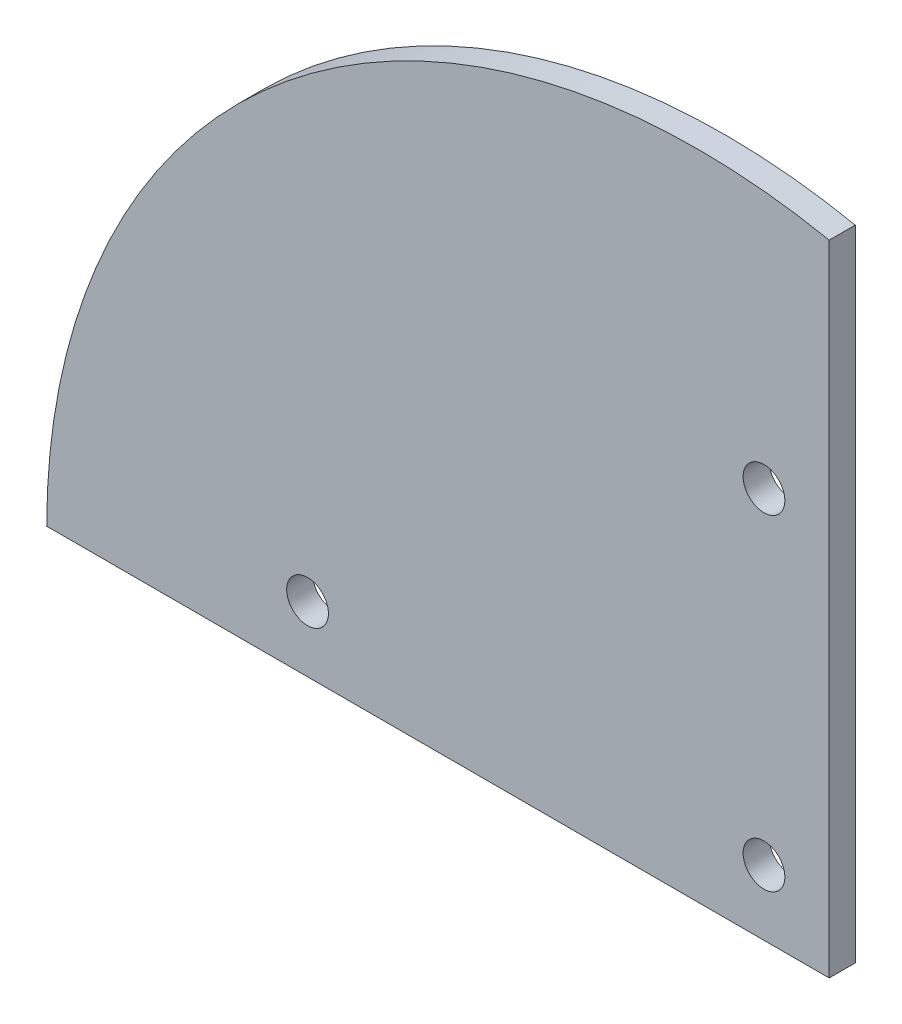
ISO-10303-21;
HEADER;
FILE_DESCRIPTION(('STEP AP214'),'2;1');
FILE_NAME('part.step','',(''),(''),'','','');
FILE_SCHEMA(('AUTOMOTIVE_DESIGN { 1 0 10303 214 1 1 1 1 }'));
ENDSEC;
DATA;
#1=APPLICATION_CONTEXT('core data for automotive mechanical design processes');
#2=APPLICATION_PROTOCOL_DEFINITION('international standard','automotive_design',2000,#1);
#3=PRODUCT_CONTEXT('',#1,'mechanical');
#4=PRODUCT('Part','Part','',(#3));
#5=PRODUCT_RELATED_PRODUCT_CATEGORY('part','',(#4));
#6=PRODUCT_DEFINITION_FORMATION('','',#4);
#7=PRODUCT_DEFINITION_CONTEXT('part definition',#1,'design');
#8=PRODUCT_DEFINITION('design','',#6,#7);
#9=PRODUCT_DEFINITION_SHAPE('','',#8);
#10=(LENGTH_UNIT() NAMED_UNIT(*) SI_UNIT(.MILLI.,.METRE.));
#11=(NAMED_UNIT(*) PLANE_ANGLE_UNIT() SI_UNIT($,.RADIAN.));
#12=(NAMED_UNIT(*) SI_UNIT($,.STERADIAN.) SOLID_ANGLE_UNIT());
#13=UNCERTAINTY_MEASURE_WITH_UNIT(LENGTH_MEASURE(1.E-05),#10,'distance_accuracy_value','');
#14=(GEOMETRIC_REPRESENTATION_CONTEXT(3) GLOBAL_UNCERTAINTY_ASSIGNED_CONTEXT((#13)) GLOBAL_UNIT_ASSIGNED_CONTEXT((#10,
#11,#12)) REPRESENTATION_CONTEXT('',''));
#15=CARTESIAN_POINT('',(0.,0.,0.));
#16=DIRECTION('',(0.,0.,1.));
#17=DIRECTION('',(1.,0.,0.));
#18=AXIS2_PLACEMENT_3D('',#15,#16,#17);
#19=CARTESIAN_POINT('',(60.,0.,2.));
#20=DIRECTION('',(-1.,0.,0.));
#21=DIRECTION('',(0.,0.,1.));
#22=AXIS2_PLACEMENT_3D('',#19,#20,#21);
#23=PLANE('',#22);
#24=DIRECTION('',(0.,1.,0.));
#25=VECTOR('',#24,1.);
#26=CARTESIAN_POINT('',(60.,0.,0.));
#27=LINE('',#26,#25);
#28=CARTESIAN_POINT('',(60.,0.,0.));
#29=VERTEX_POINT('',#28);
#30=CARTESIAN_POINT('',(60.,49.,0.));
#31=VERTEX_POINT('',#30);
#32=EDGE_CURVE('E83',#29,#31,#27,.T.);
#33=ORIENTED_EDGE('',*,*,#32,.T.);
#34=DIRECTION('',(0.,0.,-1.));
#35=VECTOR('',#34,1.);
#36=CARTESIAN_POINT('',(60.,49.,2.));
#37=LINE('',#36,#35);
#38=CARTESIAN_POINT('',(60.,49.,2.));
#39=VERTEX_POINT('',#38);
#40=EDGE_CURVE('E11',#39,#31,#37,.T.);
#41=ORIENTED_EDGE('',*,*,#40,.F.);
#42=DIRECTION('',(0.,1.,0.));
#43=VECTOR('',#42,1.);
#44=CARTESIAN_POINT('',(60.,0.,2.));
#45=LINE('',#44,#43);
#46=CARTESIAN_POINT('',(60.,0.,2.));
#47=VERTEX_POINT('',#46);
#48=EDGE_CURVE('E75',#47,#39,#45,.T.);
#49=ORIENTED_EDGE('',*,*,#48,.F.);
#50=DIRECTION('',(0.,0.,-1.));
#51=VECTOR('',#50,1.);
#52=CARTESIAN_POINT('',(60.,0.,2.));
#53=LINE('',#52,#51);
#54=EDGE_CURVE('E84',#47,#29,#53,.T.);
#55=ORIENTED_EDGE('',*,*,#54,.T.);
#56=EDGE_LOOP('',(#33,#41,#49,#55));
#57=FACE_BOUND('',#56,.T.);
#58=ADVANCED_FACE('F34',(#57),#23,.F.);
#59=CARTESIAN_POINT('',(50.0049998334028,0.00408183664968656,2.));
#60=DIRECTION('',(0.,0.,-1.));
#61=DIRECTION('',(-1.,0.,0.));
#62=AXIS2_PLACEMENT_3D('',#59,#60,#61);
#63=CYLINDRICAL_SURFACE('',#62,50.005);
#64=CARTESIAN_POINT('',(50.0049998334028,0.00408183664968656,0.));
#65=DIRECTION('',(0.,0.,1.));
#66=DIRECTION('',(1.,0.,0.));
#67=AXIS2_PLACEMENT_3D('',#64,#65,#66);
#68=CIRCLE('',#67,50.005);
#69=CARTESIAN_POINT('',(0.,0.,0.));
#70=VERTEX_POINT('',#69);
#71=EDGE_CURVE('E63',#31,#70,#68,.T.);
#72=ORIENTED_EDGE('',*,*,#71,.T.);
#73=DIRECTION('',(0.,0.,-1.));
#74=VECTOR('',#73,1.);
#75=CARTESIAN_POINT('',(0.,0.,2.));
#76=LINE('',#75,#74);
#77=CARTESIAN_POINT('',(0.,0.,2.));
#78=VERTEX_POINT('',#77);
#79=EDGE_CURVE('E43',#78,#70,#76,.T.);
#80=ORIENTED_EDGE('',*,*,#79,.F.);
#81=CARTESIAN_POINT('',(50.0049998334028,0.00408183664968656,2.));
#82=DIRECTION('',(0.,0.,1.));
#83=DIRECTION('',(1.,0.,0.));
#84=AXIS2_PLACEMENT_3D('',#81,#82,#83);
#85=CIRCLE('',#84,50.005);
#86=EDGE_CURVE('E71',#39,#78,#85,.T.);
#87=ORIENTED_EDGE('',*,*,#86,.F.);
#88=ORIENTED_EDGE('',*,*,#40,.T.);
#89=EDGE_LOOP('',(#72,#80,#87,#88));
#90=FACE_BOUND('',#89,.T.);
#91=ADVANCED_FACE('F72',(#90),#63,.T.);
#92=CARTESIAN_POINT('',(55.,5.,2.));
#93=DIRECTION('',(0.,0.,-1.));
#94=DIRECTION('',(-1.,0.,0.));
#95=AXIS2_PLACEMENT_3D('',#92,#93,#94);
#96=CYLINDRICAL_SURFACE('',#95,1.6);
#97=CARTESIAN_POINT('',(55.,5.,2.));
#98=DIRECTION('',(0.,0.,1.));
#99=DIRECTION('',(1.,0.,0.));
#100=AXIS2_PLACEMENT_3D('',#97,#98,#99);
#101=CIRCLE('',#100,1.6);
#102=CARTESIAN_POINT('',(56.6,5.,2.));
#103=VERTEX_POINT('',#102);
#104=EDGE_CURVE('E80',#103,#103,#101,.T.);
#105=ORIENTED_EDGE('',*,*,#104,.T.);
#106=EDGE_LOOP('',(#105));
#107=FACE_BOUND('',#106,.T.);
#108=CARTESIAN_POINT('',(55.,5.,0.));
#109=DIRECTION('',(0.,0.,1.));
#110=DIRECTION('',(1.,0.,0.));
#111=AXIS2_PLACEMENT_3D('',#108,#109,#110);
#112=CIRCLE('',#111,1.6);
#113=CARTESIAN_POINT('',(56.6,5.,0.));
#114=VERTEX_POINT('',#113);
#115=EDGE_CURVE('E86',#114,#114,#112,.T.);
#116=ORIENTED_EDGE('',*,*,#115,.F.);
#117=EDGE_LOOP('',(#116));
#118=FACE_BOUND('',#117,.T.);
#119=ADVANCED_FACE('F114',(#107,#118),#96,.F.);
#120=CARTESIAN_POINT('',(55.,30.,2.));
#121=DIRECTION('',(0.,0.,-1.));
#122=DIRECTION('',(-1.,0.,0.));
#123=AXIS2_PLACEMENT_3D('',#120,#121,#122);
#124=CYLINDRICAL_SURFACE('',#123,1.6);
#125=CARTESIAN_POINT('',(55.,30.,2.));
#126=DIRECTION('',(0.,0.,1.));
#127=DIRECTION('',(1.,0.,0.));
#128=AXIS2_PLACEMENT_3D('',#125,#126,#127);
#129=CIRCLE('',#128,1.6);
#130=CARTESIAN_POINT('',(56.6,30.,2.));
#131=VERTEX_POINT('',#130);
#132=EDGE_CURVE('E129',#131,#131,#129,.T.);
#133=ORIENTED_EDGE('',*,*,#132,.T.);
#134=EDGE_LOOP('',(#133));
#135=FACE_BOUND('',#134,.T.);
#136=CARTESIAN_POINT('',(55.,30.,0.));
#137=DIRECTION('',(0.,0.,1.));
#138=DIRECTION('',(1.,0.,0.));
#139=AXIS2_PLACEMENT_3D('',#136,#137,#138);
#140=CIRCLE('',#139,1.6);
#141=CARTESIAN_POINT('',(56.6,30.,0.));
#142=VERTEX_POINT('',#141);
#143=EDGE_CURVE('E90',#142,#142,#140,.T.);
#144=ORIENTED_EDGE('',*,*,#143,.F.);
#145=EDGE_LOOP('',(#144));
#146=FACE_BOUND('',#145,.T.);
#147=ADVANCED_FACE('F118',(#135,#146),#124,.F.);
#148=CARTESIAN_POINT('',(20.,5.,2.));
#149=DIRECTION('',(0.,0.,-1.));
#150=DIRECTION('',(-1.,0.,0.));
#151=AXIS2_PLACEMENT_3D('',#148,#149,#150);
#152=CYLINDRICAL_SURFACE('',#151,1.6);
#153=CARTESIAN_POINT('',(20.,5.,2.));
#154=DIRECTION('',(0.,0.,1.));
#155=DIRECTION('',(1.,0.,0.));
#156=AXIS2_PLACEMENT_3D('',#153,#154,#155);
#157=CIRCLE('',#156,1.6);
#158=CARTESIAN_POINT('',(21.6,5.,2.));
#159=VERTEX_POINT('',#158);
#160=EDGE_CURVE('E95',#159,#159,#157,.T.);
#161=ORIENTED_EDGE('',*,*,#160,.T.);
#162=EDGE_LOOP('',(#161));
#163=FACE_BOUND('',#162,.T.);
#164=CARTESIAN_POINT('',(20.,5.,0.));
#165=DIRECTION('',(0.,0.,1.));
#166=DIRECTION('',(1.,0.,0.));
#167=AXIS2_PLACEMENT_3D('',#164,#165,#166);
#168=CIRCLE('',#167,1.6);
#169=CARTESIAN_POINT('',(21.6,5.,0.));
#170=VERTEX_POINT('',#169);
#171=EDGE_CURVE('E132',#170,#170,#168,.T.);
#172=ORIENTED_EDGE('',*,*,#171,.F.);
#173=EDGE_LOOP('',(#172));
#174=FACE_BOUND('',#173,.T.);
#175=ADVANCED_FACE('F36',(#163,#174),#152,.F.);
#176=CARTESIAN_POINT('',(0.,0.,2.));
#177=DIRECTION('',(0.,1.,0.));
#178=DIRECTION('',(0.,0.,1.));
#179=AXIS2_PLACEMENT_3D('',#176,#177,#178);
#180=PLANE('',#179);
#181=DIRECTION('',(1.,0.,0.));
#182=VECTOR('',#181,1.);
#183=CARTESIAN_POINT('',(0.,0.,0.));
#184=LINE('',#183,#182);
#185=EDGE_CURVE('E68',#70,#29,#184,.T.);
#186=ORIENTED_EDGE('',*,*,#185,.T.);
#187=ORIENTED_EDGE('',*,*,#54,.F.);
#188=DIRECTION('',(1.,0.,0.));
#189=VECTOR('',#188,1.);
#190=CARTESIAN_POINT('',(0.,0.,2.));
#191=LINE('',#190,#189);
#192=EDGE_CURVE('E51',#78,#47,#191,.T.);
#193=ORIENTED_EDGE('',*,*,#192,.F.);
#194=ORIENTED_EDGE('',*,*,#79,.T.);
#195=EDGE_LOOP('',(#186,#187,#193,#194));
#196=FACE_BOUND('',#195,.T.);
#197=ADVANCED_FACE('F96',(#196),#180,.F.);
#198=CARTESIAN_POINT('',(0.,0.,2.));
#199=DIRECTION('',(0.,0.,1.));
#200=DIRECTION('',(1.,0.,0.));
#201=AXIS2_PLACEMENT_3D('',#198,#199,#200);
#202=PLANE('',#201);
#203=ORIENTED_EDGE('',*,*,#160,.F.);
#204=EDGE_LOOP('',(#203));
#205=FACE_BOUND('',#204,.T.);
#206=ORIENTED_EDGE('',*,*,#132,.F.);
#207=EDGE_LOOP('',(#206));
#208=FACE_BOUND('',#207,.T.);
#209=ORIENTED_EDGE('',*,*,#104,.F.);
#210=EDGE_LOOP('',(#209));
#211=FACE_BOUND('',#210,.T.);
#212=ORIENTED_EDGE('',*,*,#48,.T.);
#213=ORIENTED_EDGE('',*,*,#86,.T.);
#214=ORIENTED_EDGE('',*,*,#192,.T.);
#215=EDGE_LOOP('',(#212,#213,#214));
#216=FACE_BOUND('',#215,.T.);
#217=ADVANCED_FACE('F78',(#205,#208,#211,#216),#202,.T.);
#218=CARTESIAN_POINT('',(0.,0.,0.));
#219=DIRECTION('',(0.,0.,1.));
#220=DIRECTION('',(1.,0.,0.));
#221=AXIS2_PLACEMENT_3D('',#218,#219,#220);
#222=PLANE('',#221);
#223=ORIENTED_EDGE('',*,*,#171,.T.);
#224=EDGE_LOOP('',(#223));
#225=FACE_BOUND('',#224,.T.);
#226=ORIENTED_EDGE('',*,*,#143,.T.);
#227=EDGE_LOOP('',(#226));
#228=FACE_BOUND('',#227,.T.);
#229=ORIENTED_EDGE('',*,*,#115,.T.);
#230=EDGE_LOOP('',(#229));
#231=FACE_BOUND('',#230,.T.);
#232=ORIENTED_EDGE('',*,*,#32,.F.);
#233=ORIENTED_EDGE('',*,*,#185,.F.);
#234=ORIENTED_EDGE('',*,*,#71,.F.);
#235=EDGE_LOOP('',(#232,#233,#234));
#236=FACE_BOUND('',#235,.T.);
#237=ADVANCED_FACE('F97',(#225,#228,#231,#236),#222,.F.);
#238=CLOSED_SHELL('',(#58,#91,#119,#147,#175,#197,#217,#237));
#239=MANIFOLD_SOLID_BREP('B2',#238);
#240=ADVANCED_BREP_SHAPE_REPRESENTATION('',(#18,#239),#14);
#241=SHAPE_DEFINITION_REPRESENTATION(#9,#240);
ENDSEC;
END-ISO-10303-21;
